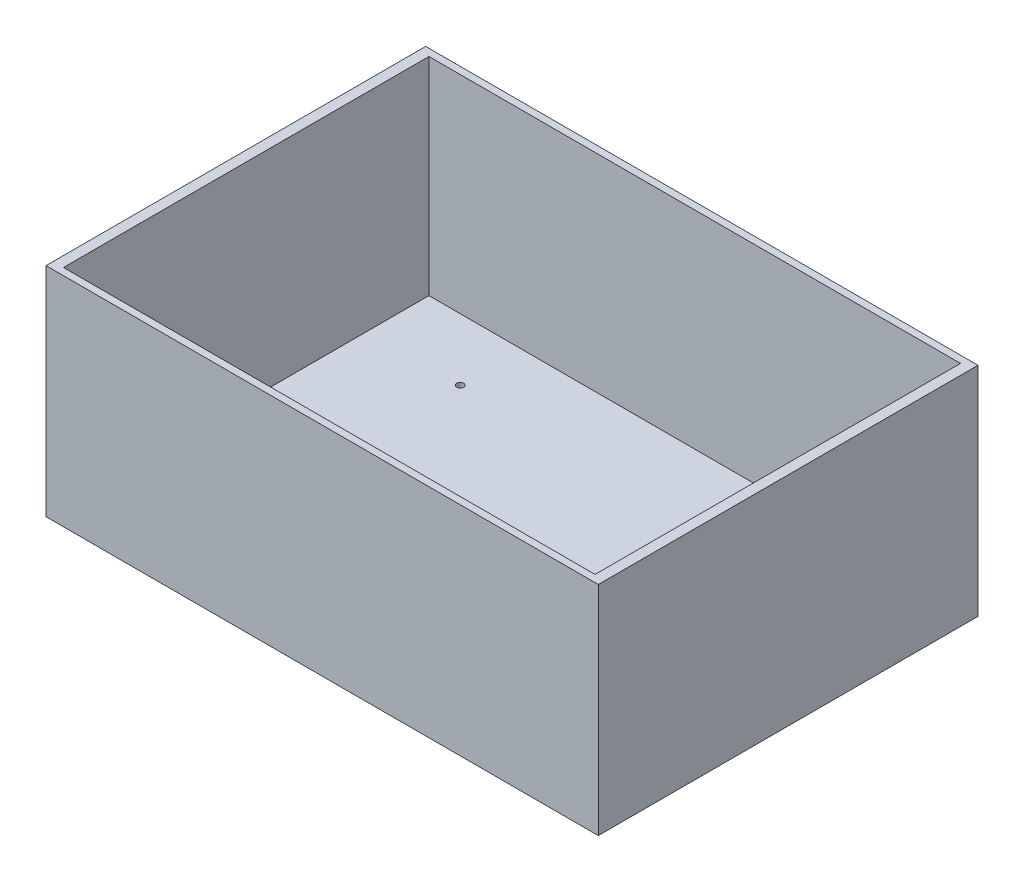
ISO-10303-21;
HEADER;
FILE_DESCRIPTION(('STEP AP214'),'2;1');
FILE_NAME('part.step','',(''),(''),'','','');
FILE_SCHEMA(('AUTOMOTIVE_DESIGN { 1 0 10303 214 1 1 1 1 }'));
ENDSEC;
DATA;
#1=APPLICATION_CONTEXT('core data for automotive mechanical design processes');
#2=APPLICATION_PROTOCOL_DEFINITION('international standard','automotive_design',2000,#1);
#3=PRODUCT_CONTEXT('',#1,'mechanical');
#4=PRODUCT('Part','Part','',(#3));
#5=PRODUCT_RELATED_PRODUCT_CATEGORY('part','',(#4));
#6=PRODUCT_DEFINITION_FORMATION('','',#4);
#7=PRODUCT_DEFINITION_CONTEXT('part definition',#1,'design');
#8=PRODUCT_DEFINITION('design','',#6,#7);
#9=PRODUCT_DEFINITION_SHAPE('','',#8);
#10=(LENGTH_UNIT() NAMED_UNIT(*) SI_UNIT(.MILLI.,.METRE.));
#11=(NAMED_UNIT(*) PLANE_ANGLE_UNIT() SI_UNIT($,.RADIAN.));
#12=(NAMED_UNIT(*) SI_UNIT($,.STERADIAN.) SOLID_ANGLE_UNIT());
#13=UNCERTAINTY_MEASURE_WITH_UNIT(LENGTH_MEASURE(1.E-05),#10,'distance_accuracy_value','');
#14=(GEOMETRIC_REPRESENTATION_CONTEXT(3) GLOBAL_UNCERTAINTY_ASSIGNED_CONTEXT((#13)) GLOBAL_UNIT_ASSIGNED_CONTEXT((#10,
#11,#12)) REPRESENTATION_CONTEXT('',''));
#15=CARTESIAN_POINT('',(0.,0.,0.));
#16=DIRECTION('',(0.,0.,1.));
#17=DIRECTION('',(1.,0.,0.));
#18=AXIS2_PLACEMENT_3D('',#15,#16,#17);
#19=CARTESIAN_POINT('',(80.,3.,-55.));
#20=DIRECTION('',(-1.,0.,0.));
#21=DIRECTION('',(0.,0.,1.));
#22=AXIS2_PLACEMENT_3D('',#19,#20,#21);
#23=PLANE('',#22);
#24=DIRECTION('',(0.,0.,-1.));
#25=VECTOR('',#24,1.);
#26=CARTESIAN_POINT('',(80.,0.,-55.));
#27=LINE('',#26,#25);
#28=CARTESIAN_POINT('',(80.,0.,55.));
#29=VERTEX_POINT('',#28);
#30=CARTESIAN_POINT('',(80.,0.,-55.));
#31=VERTEX_POINT('',#30);
#32=EDGE_CURVE('E148',#29,#31,#27,.T.);
#33=ORIENTED_EDGE('',*,*,#32,.T.);
#34=DIRECTION('',(0.,-1.,0.));
#35=VECTOR('',#34,1.);
#36=CARTESIAN_POINT('',(80.,3.,-55.));
#37=LINE('',#36,#35);
#38=CARTESIAN_POINT('',(80.,63.,-55.));
#39=VERTEX_POINT('',#38);
#40=EDGE_CURVE('E11',#39,#31,#37,.T.);
#41=ORIENTED_EDGE('',*,*,#40,.F.);
#42=DIRECTION('',(0.,0.,-1.));
#43=VECTOR('',#42,1.);
#44=CARTESIAN_POINT('',(80.,63.,-55.));
#45=LINE('',#44,#43);
#46=CARTESIAN_POINT('',(80.,63.,55.));
#47=VERTEX_POINT('',#46);
#48=EDGE_CURVE('E113',#47,#39,#45,.T.);
#49=ORIENTED_EDGE('',*,*,#48,.F.);
#50=DIRECTION('',(0.,-1.,0.));
#51=VECTOR('',#50,1.);
#52=CARTESIAN_POINT('',(80.,3.,55.));
#53=LINE('',#52,#51);
#54=EDGE_CURVE('E157',#47,#29,#53,.T.);
#55=ORIENTED_EDGE('',*,*,#54,.T.);
#56=EDGE_LOOP('',(#33,#41,#49,#55));
#57=FACE_BOUND('',#56,.T.);
#58=ADVANCED_FACE('F35',(#57),#23,.F.);
#59=CARTESIAN_POINT('',(-80.,3.,-55.));
#60=DIRECTION('',(0.,0.,1.));
#61=DIRECTION('',(1.,0.,0.));
#62=AXIS2_PLACEMENT_3D('',#59,#60,#61);
#63=PLANE('',#62);
#64=DIRECTION('',(-1.,0.,0.));
#65=VECTOR('',#64,1.);
#66=CARTESIAN_POINT('',(-80.,0.,-55.));
#67=LINE('',#66,#65);
#68=CARTESIAN_POINT('',(-80.,0.,-55.));
#69=VERTEX_POINT('',#68);
#70=EDGE_CURVE('E151',#31,#69,#67,.T.);
#71=ORIENTED_EDGE('',*,*,#70,.T.);
#72=DIRECTION('',(0.,-1.,0.));
#73=VECTOR('',#72,1.);
#74=CARTESIAN_POINT('',(-80.,3.,-55.));
#75=LINE('',#74,#73);
#76=CARTESIAN_POINT('',(-80.,63.,-55.));
#77=VERTEX_POINT('',#76);
#78=EDGE_CURVE('E42',#77,#69,#75,.T.);
#79=ORIENTED_EDGE('',*,*,#78,.F.);
#80=DIRECTION('',(-1.,0.,0.));
#81=VECTOR('',#80,1.);
#82=CARTESIAN_POINT('',(-80.,63.,-55.));
#83=LINE('',#82,#81);
#84=EDGE_CURVE('E139',#39,#77,#83,.T.);
#85=ORIENTED_EDGE('',*,*,#84,.F.);
#86=ORIENTED_EDGE('',*,*,#40,.T.);
#87=EDGE_LOOP('',(#71,#79,#85,#86));
#88=FACE_BOUND('',#87,.T.);
#89=ADVANCED_FACE('F179',(#88),#63,.F.);
#90=CARTESIAN_POINT('',(-80.,3.,-55.));
#91=DIRECTION('',(1.,0.,0.));
#92=DIRECTION('',(0.,0.,-1.));
#93=AXIS2_PLACEMENT_3D('',#90,#91,#92);
#94=PLANE('',#93);
#95=DIRECTION('',(0.,0.,1.));
#96=VECTOR('',#95,1.);
#97=CARTESIAN_POINT('',(-80.,0.,-55.));
#98=LINE('',#97,#96);
#99=CARTESIAN_POINT('',(-80.,0.,55.));
#100=VERTEX_POINT('',#99);
#101=EDGE_CURVE('E153',#69,#100,#98,.T.);
#102=ORIENTED_EDGE('',*,*,#101,.T.);
#103=DIRECTION('',(0.,-1.,0.));
#104=VECTOR('',#103,1.);
#105=CARTESIAN_POINT('',(-80.,3.,55.));
#106=LINE('',#105,#104);
#107=CARTESIAN_POINT('',(-80.,63.,55.));
#108=VERTEX_POINT('',#107);
#109=EDGE_CURVE('E160',#108,#100,#106,.T.);
#110=ORIENTED_EDGE('',*,*,#109,.F.);
#111=DIRECTION('',(0.,0.,1.));
#112=VECTOR('',#111,1.);
#113=CARTESIAN_POINT('',(-80.,63.,-55.));
#114=LINE('',#113,#112);
#115=EDGE_CURVE('E142',#77,#108,#114,.T.);
#116=ORIENTED_EDGE('',*,*,#115,.F.);
#117=ORIENTED_EDGE('',*,*,#78,.T.);
#118=EDGE_LOOP('',(#102,#110,#116,#117));
#119=FACE_BOUND('',#118,.T.);
#120=ADVANCED_FACE('F166',(#119),#94,.F.);
#121=CARTESIAN_POINT('',(-80.,3.,55.));
#122=DIRECTION('',(0.,0.,-1.));
#123=DIRECTION('',(-1.,0.,0.));
#124=AXIS2_PLACEMENT_3D('',#121,#122,#123);
#125=PLANE('',#124);
#126=DIRECTION('',(1.,0.,0.));
#127=VECTOR('',#126,1.);
#128=CARTESIAN_POINT('',(-80.,0.,55.));
#129=LINE('',#128,#127);
#130=EDGE_CURVE('E155',#100,#29,#129,.T.);
#131=ORIENTED_EDGE('',*,*,#130,.T.);
#132=ORIENTED_EDGE('',*,*,#54,.F.);
#133=DIRECTION('',(1.,0.,0.));
#134=VECTOR('',#133,1.);
#135=CARTESIAN_POINT('',(-80.,63.,55.));
#136=LINE('',#135,#134);
#137=EDGE_CURVE('E145',#108,#47,#136,.T.);
#138=ORIENTED_EDGE('',*,*,#137,.F.);
#139=ORIENTED_EDGE('',*,*,#109,.T.);
#140=EDGE_LOOP('',(#131,#132,#138,#139));
#141=FACE_BOUND('',#140,.T.);
#142=ADVANCED_FACE('F174',(#141),#125,.F.);
#143=CARTESIAN_POINT('',(0.,0.,0.));
#144=DIRECTION('',(0.,1.,0.));
#145=DIRECTION('',(0.,0.,1.));
#146=AXIS2_PLACEMENT_3D('',#143,#144,#145);
#147=PLANE('',#146);
#148=CARTESIAN_POINT('',(-50.,0.,35.));
#149=DIRECTION('',(0.,1.,0.));
#150=DIRECTION('',(0.,0.,1.));
#151=AXIS2_PLACEMENT_3D('',#148,#149,#150);
#152=CIRCLE('',#151,0.999999999999998);
#153=CARTESIAN_POINT('',(-50.,0.,36.));
#154=VERTEX_POINT('',#153);
#155=EDGE_CURVE('E127',#154,#154,#152,.T.);
#156=ORIENTED_EDGE('',*,*,#155,.T.);
#157=EDGE_LOOP('',(#156));
#158=FACE_BOUND('',#157,.T.);
#159=CARTESIAN_POINT('',(50.,0.,35.));
#160=DIRECTION('',(0.,1.,0.));
#161=DIRECTION('',(0.,0.,1.));
#162=AXIS2_PLACEMENT_3D('',#159,#160,#161);
#163=CIRCLE('',#162,0.999999999999998);
#164=CARTESIAN_POINT('',(50.,0.,36.));
#165=VERTEX_POINT('',#164);
#166=EDGE_CURVE('E235',#165,#165,#163,.T.);
#167=ORIENTED_EDGE('',*,*,#166,.T.);
#168=EDGE_LOOP('',(#167));
#169=FACE_BOUND('',#168,.T.);
#170=CARTESIAN_POINT('',(50.,0.,-35.));
#171=DIRECTION('',(0.,1.,0.));
#172=DIRECTION('',(0.,0.,1.));
#173=AXIS2_PLACEMENT_3D('',#170,#171,#172);
#174=CIRCLE('',#173,0.999999999999998);
#175=CARTESIAN_POINT('',(50.,0.,-34.));
#176=VERTEX_POINT('',#175);
#177=EDGE_CURVE('E233',#176,#176,#174,.T.);
#178=ORIENTED_EDGE('',*,*,#177,.T.);
#179=EDGE_LOOP('',(#178));
#180=FACE_BOUND('',#179,.T.);
#181=CARTESIAN_POINT('',(-50.,0.,-35.));
#182=DIRECTION('',(0.,1.,0.));
#183=DIRECTION('',(0.,0.,1.));
#184=AXIS2_PLACEMENT_3D('',#181,#182,#183);
#185=CIRCLE('',#184,0.999999999999998);
#186=CARTESIAN_POINT('',(-50.,0.,-34.));
#187=VERTEX_POINT('',#186);
#188=EDGE_CURVE('E236',#187,#187,#185,.T.);
#189=ORIENTED_EDGE('',*,*,#188,.T.);
#190=EDGE_LOOP('',(#189));
#191=FACE_BOUND('',#190,.T.);
#192=ORIENTED_EDGE('',*,*,#32,.F.);
#193=ORIENTED_EDGE('',*,*,#130,.F.);
#194=ORIENTED_EDGE('',*,*,#101,.F.);
#195=ORIENTED_EDGE('',*,*,#70,.F.);
#196=EDGE_LOOP('',(#192,#193,#194,#195));
#197=FACE_BOUND('',#196,.T.);
#198=ADVANCED_FACE('F172',(#158,#169,#180,#191,#197),#147,.F.);
#199=CARTESIAN_POINT('',(0.,63.,0.));
#200=DIRECTION('',(0.,1.,0.));
#201=DIRECTION('',(0.,0.,1.));
#202=AXIS2_PLACEMENT_3D('',#199,#200,#201);
#203=PLANE('',#202);
#204=ORIENTED_EDGE('',*,*,#48,.T.);
#205=ORIENTED_EDGE('',*,*,#84,.T.);
#206=ORIENTED_EDGE('',*,*,#115,.T.);
#207=ORIENTED_EDGE('',*,*,#137,.T.);
#208=EDGE_LOOP('',(#204,#205,#206,#207));
#209=FACE_BOUND('',#208,.T.);
#210=DIRECTION('',(-1.,0.,0.));
#211=VECTOR('',#210,1.);
#212=CARTESIAN_POINT('',(-77.,63.,-52.9375));
#213=LINE('',#212,#211);
#214=CARTESIAN_POINT('',(77.,63.,-52.9375));
#215=VERTEX_POINT('',#214);
#216=CARTESIAN_POINT('',(-77.,63.,-52.9375));
#217=VERTEX_POINT('',#216);
#218=EDGE_CURVE('E107',#215,#217,#213,.T.);
#219=ORIENTED_EDGE('',*,*,#218,.F.);
#220=DIRECTION('',(0.,0.,-1.));
#221=VECTOR('',#220,1.);
#222=CARTESIAN_POINT('',(77.,63.,-52.9375));
#223=LINE('',#222,#221);
#224=CARTESIAN_POINT('',(77.,63.,52.9375));
#225=VERTEX_POINT('',#224);
#226=EDGE_CURVE('E98',#225,#215,#223,.T.);
#227=ORIENTED_EDGE('',*,*,#226,.F.);
#228=DIRECTION('',(1.,0.,0.));
#229=VECTOR('',#228,1.);
#230=CARTESIAN_POINT('',(-77.,63.,52.9375));
#231=LINE('',#230,#229);
#232=CARTESIAN_POINT('',(-77.,63.,52.9375));
#233=VERTEX_POINT('',#232);
#234=EDGE_CURVE('E121',#233,#225,#231,.T.);
#235=ORIENTED_EDGE('',*,*,#234,.F.);
#236=DIRECTION('',(0.,0.,1.));
#237=VECTOR('',#236,1.);
#238=CARTESIAN_POINT('',(-77.,63.,-52.9375));
#239=LINE('',#238,#237);
#240=EDGE_CURVE('E119',#217,#233,#239,.T.);
#241=ORIENTED_EDGE('',*,*,#240,.F.);
#242=EDGE_LOOP('',(#219,#227,#235,#241));
#243=FACE_BOUND('',#242,.T.);
#244=ADVANCED_FACE('F117',(#209,#243),#203,.T.);
#245=CARTESIAN_POINT('',(77.,63.,-52.9375));
#246=DIRECTION('',(-1.,0.,0.));
#247=DIRECTION('',(0.,0.,1.));
#248=AXIS2_PLACEMENT_3D('',#245,#246,#247);
#249=PLANE('',#248);
#250=DIRECTION('',(0.,0.,-1.));
#251=VECTOR('',#250,1.);
#252=CARTESIAN_POINT('',(77.,3.,-52.9375));
#253=LINE('',#252,#251);
#254=CARTESIAN_POINT('',(77.,3.,52.9375));
#255=VERTEX_POINT('',#254);
#256=CARTESIAN_POINT('',(77.,3.,-52.9375));
#257=VERTEX_POINT('',#256);
#258=EDGE_CURVE('E49',#255,#257,#253,.T.);
#259=ORIENTED_EDGE('',*,*,#258,.F.);
#260=DIRECTION('',(0.,-1.,0.));
#261=VECTOR('',#260,1.);
#262=CARTESIAN_POINT('',(77.,63.,52.9375));
#263=LINE('',#262,#261);
#264=EDGE_CURVE('E103',#225,#255,#263,.T.);
#265=ORIENTED_EDGE('',*,*,#264,.F.);
#266=ORIENTED_EDGE('',*,*,#226,.T.);
#267=DIRECTION('',(0.,-1.,0.));
#268=VECTOR('',#267,1.);
#269=CARTESIAN_POINT('',(77.,63.,-52.9375));
#270=LINE('',#269,#268);
#271=EDGE_CURVE('E101',#215,#257,#270,.T.);
#272=ORIENTED_EDGE('',*,*,#271,.T.);
#273=EDGE_LOOP('',(#259,#265,#266,#272));
#274=FACE_BOUND('',#273,.T.);
#275=ADVANCED_FACE('F100',(#274),#249,.T.);
#276=CARTESIAN_POINT('',(-77.,63.,-52.9375));
#277=DIRECTION('',(0.,0.,1.));
#278=DIRECTION('',(1.,0.,0.));
#279=AXIS2_PLACEMENT_3D('',#276,#277,#278);
#280=PLANE('',#279);
#281=DIRECTION('',(-1.,0.,0.));
#282=VECTOR('',#281,1.);
#283=CARTESIAN_POINT('',(-77.,3.,-52.9375));
#284=LINE('',#283,#282);
#285=CARTESIAN_POINT('',(-77.,3.,-52.9375));
#286=VERTEX_POINT('',#285);
#287=EDGE_CURVE('E53',#257,#286,#284,.T.);
#288=ORIENTED_EDGE('',*,*,#287,.F.);
#289=ORIENTED_EDGE('',*,*,#271,.F.);
#290=ORIENTED_EDGE('',*,*,#218,.T.);
#291=DIRECTION('',(0.,-1.,0.));
#292=VECTOR('',#291,1.);
#293=CARTESIAN_POINT('',(-77.,63.,-52.9375));
#294=LINE('',#293,#292);
#295=EDGE_CURVE('E114',#217,#286,#294,.T.);
#296=ORIENTED_EDGE('',*,*,#295,.T.);
#297=EDGE_LOOP('',(#288,#289,#290,#296));
#298=FACE_BOUND('',#297,.T.);
#299=ADVANCED_FACE('F111',(#298),#280,.T.);
#300=CARTESIAN_POINT('',(-77.,63.,-52.9375));
#301=DIRECTION('',(1.,0.,0.));
#302=DIRECTION('',(0.,0.,-1.));
#303=AXIS2_PLACEMENT_3D('',#300,#301,#302);
#304=PLANE('',#303);
#305=DIRECTION('',(0.,0.,1.));
#306=VECTOR('',#305,1.);
#307=CARTESIAN_POINT('',(-77.,3.,-52.9375));
#308=LINE('',#307,#306);
#309=CARTESIAN_POINT('',(-77.,3.,52.9375));
#310=VERTEX_POINT('',#309);
#311=EDGE_CURVE('E129',#286,#310,#308,.T.);
#312=ORIENTED_EDGE('',*,*,#311,.F.);
#313=ORIENTED_EDGE('',*,*,#295,.F.);
#314=ORIENTED_EDGE('',*,*,#240,.T.);
#315=DIRECTION('',(0.,-1.,0.));
#316=VECTOR('',#315,1.);
#317=CARTESIAN_POINT('',(-77.,63.,52.9375));
#318=LINE('',#317,#316);
#319=EDGE_CURVE('E133',#233,#310,#318,.T.);
#320=ORIENTED_EDGE('',*,*,#319,.T.);
#321=EDGE_LOOP('',(#312,#313,#314,#320));
#322=FACE_BOUND('',#321,.T.);
#323=ADVANCED_FACE('F204',(#322),#304,.T.);
#324=CARTESIAN_POINT('',(-77.,63.,52.9375));
#325=DIRECTION('',(0.,0.,-1.));
#326=DIRECTION('',(-1.,0.,0.));
#327=AXIS2_PLACEMENT_3D('',#324,#325,#326);
#328=PLANE('',#327);
#329=DIRECTION('',(1.,0.,0.));
#330=VECTOR('',#329,1.);
#331=CARTESIAN_POINT('',(-77.,3.,52.9375));
#332=LINE('',#331,#330);
#333=EDGE_CURVE('E108',#310,#255,#332,.T.);
#334=ORIENTED_EDGE('',*,*,#333,.F.);
#335=ORIENTED_EDGE('',*,*,#319,.F.);
#336=ORIENTED_EDGE('',*,*,#234,.T.);
#337=ORIENTED_EDGE('',*,*,#264,.T.);
#338=EDGE_LOOP('',(#334,#335,#336,#337));
#339=FACE_BOUND('',#338,.T.);
#340=ADVANCED_FACE('F196',(#339),#328,.T.);
#341=CARTESIAN_POINT('',(0.,3.,0.));
#342=DIRECTION('',(0.,1.,0.));
#343=DIRECTION('',(0.,0.,1.));
#344=AXIS2_PLACEMENT_3D('',#341,#342,#343);
#345=PLANE('',#344);
#346=CARTESIAN_POINT('',(-50.,3.,35.));
#347=DIRECTION('',(0.,1.,0.));
#348=DIRECTION('',(0.,0.,1.));
#349=AXIS2_PLACEMENT_3D('',#346,#347,#348);
#350=CIRCLE('',#349,0.999999999999998);
#351=CARTESIAN_POINT('',(-50.,3.,36.));
#352=VERTEX_POINT('',#351);
#353=EDGE_CURVE('E255',#352,#352,#350,.T.);
#354=ORIENTED_EDGE('',*,*,#353,.F.);
#355=EDGE_LOOP('',(#354));
#356=FACE_BOUND('',#355,.T.);
#357=CARTESIAN_POINT('',(50.,3.,35.));
#358=DIRECTION('',(0.,1.,0.));
#359=DIRECTION('',(0.,0.,1.));
#360=AXIS2_PLACEMENT_3D('',#357,#358,#359);
#361=CIRCLE('',#360,0.999999999999998);
#362=CARTESIAN_POINT('',(50.,3.,36.));
#363=VERTEX_POINT('',#362);
#364=EDGE_CURVE('E258',#363,#363,#361,.T.);
#365=ORIENTED_EDGE('',*,*,#364,.F.);
#366=EDGE_LOOP('',(#365));
#367=FACE_BOUND('',#366,.T.);
#368=CARTESIAN_POINT('',(50.,3.,-35.));
#369=DIRECTION('',(0.,1.,0.));
#370=DIRECTION('',(0.,0.,1.));
#371=AXIS2_PLACEMENT_3D('',#368,#369,#370);
#372=CIRCLE('',#371,0.999999999999998);
#373=CARTESIAN_POINT('',(50.,3.,-34.));
#374=VERTEX_POINT('',#373);
#375=EDGE_CURVE('E230',#374,#374,#372,.T.);
#376=ORIENTED_EDGE('',*,*,#375,.F.);
#377=EDGE_LOOP('',(#376));
#378=FACE_BOUND('',#377,.T.);
#379=CARTESIAN_POINT('',(-50.,3.,-35.));
#380=DIRECTION('',(0.,1.,0.));
#381=DIRECTION('',(0.,0.,1.));
#382=AXIS2_PLACEMENT_3D('',#379,#380,#381);
#383=CIRCLE('',#382,0.999999999999998);
#384=CARTESIAN_POINT('',(-50.,3.,-34.));
#385=VERTEX_POINT('',#384);
#386=EDGE_CURVE('E241',#385,#385,#383,.T.);
#387=ORIENTED_EDGE('',*,*,#386,.F.);
#388=EDGE_LOOP('',(#387));
#389=FACE_BOUND('',#388,.T.);
#390=ORIENTED_EDGE('',*,*,#258,.T.);
#391=ORIENTED_EDGE('',*,*,#287,.T.);
#392=ORIENTED_EDGE('',*,*,#311,.T.);
#393=ORIENTED_EDGE('',*,*,#333,.T.);
#394=EDGE_LOOP('',(#390,#391,#392,#393));
#395=FACE_BOUND('',#394,.T.);
#396=ADVANCED_FACE('F192',(#356,#367,#378,#389,#395),#345,.T.);
#397=CARTESIAN_POINT('',(-50.,-7.,-35.));
#398=DIRECTION('',(0.,1.,0.));
#399=DIRECTION('',(0.,0.,1.));
#400=AXIS2_PLACEMENT_3D('',#397,#398,#399);
#401=CYLINDRICAL_SURFACE('',#400,0.999999999999998);
#402=ORIENTED_EDGE('',*,*,#386,.T.);
#403=EDGE_LOOP('',(#402));
#404=FACE_BOUND('',#403,.T.);
#405=ORIENTED_EDGE('',*,*,#188,.F.);
#406=EDGE_LOOP('',(#405));
#407=FACE_BOUND('',#406,.T.);
#408=ADVANCED_FACE('F195',(#404,#407),#401,.F.);
#409=CARTESIAN_POINT('',(50.,-7.,-35.));
#410=DIRECTION('',(0.,1.,0.));
#411=DIRECTION('',(0.,0.,1.));
#412=AXIS2_PLACEMENT_3D('',#409,#410,#411);
#413=CYLINDRICAL_SURFACE('',#412,0.999999999999998);
#414=ORIENTED_EDGE('',*,*,#375,.T.);
#415=EDGE_LOOP('',(#414));
#416=FACE_BOUND('',#415,.T.);
#417=ORIENTED_EDGE('',*,*,#177,.F.);
#418=EDGE_LOOP('',(#417));
#419=FACE_BOUND('',#418,.T.);
#420=ADVANCED_FACE('F213',(#416,#419),#413,.F.);
#421=CARTESIAN_POINT('',(50.,-7.,35.));
#422=DIRECTION('',(0.,1.,0.));
#423=DIRECTION('',(0.,0.,1.));
#424=AXIS2_PLACEMENT_3D('',#421,#422,#423);
#425=CYLINDRICAL_SURFACE('',#424,0.999999999999998);
#426=ORIENTED_EDGE('',*,*,#364,.T.);
#427=EDGE_LOOP('',(#426));
#428=FACE_BOUND('',#427,.T.);
#429=ORIENTED_EDGE('',*,*,#166,.F.);
#430=EDGE_LOOP('',(#429));
#431=FACE_BOUND('',#430,.T.);
#432=ADVANCED_FACE('F218',(#428,#431),#425,.F.);
#433=CARTESIAN_POINT('',(-50.,-7.,35.));
#434=DIRECTION('',(0.,1.,0.));
#435=DIRECTION('',(0.,0.,1.));
#436=AXIS2_PLACEMENT_3D('',#433,#434,#435);
#437=CYLINDRICAL_SURFACE('',#436,0.999999999999998);
#438=ORIENTED_EDGE('',*,*,#353,.T.);
#439=EDGE_LOOP('',(#438));
#440=FACE_BOUND('',#439,.T.);
#441=ORIENTED_EDGE('',*,*,#155,.F.);
#442=EDGE_LOOP('',(#441));
#443=FACE_BOUND('',#442,.T.);
#444=ADVANCED_FACE('F215',(#440,#443),#437,.F.);
#445=CLOSED_SHELL('',(#58,#89,#120,#142,#198,#244,#275,#299,#323,#340,#396,#408,#420,#432,#444));
#446=MANIFOLD_SOLID_BREP('B2',#445);
#447=ADVANCED_BREP_SHAPE_REPRESENTATION('',(#18,#446),#14);
#448=SHAPE_DEFINITION_REPRESENTATION(#9,#447);
ENDSEC;
END-ISO-10303-21;
